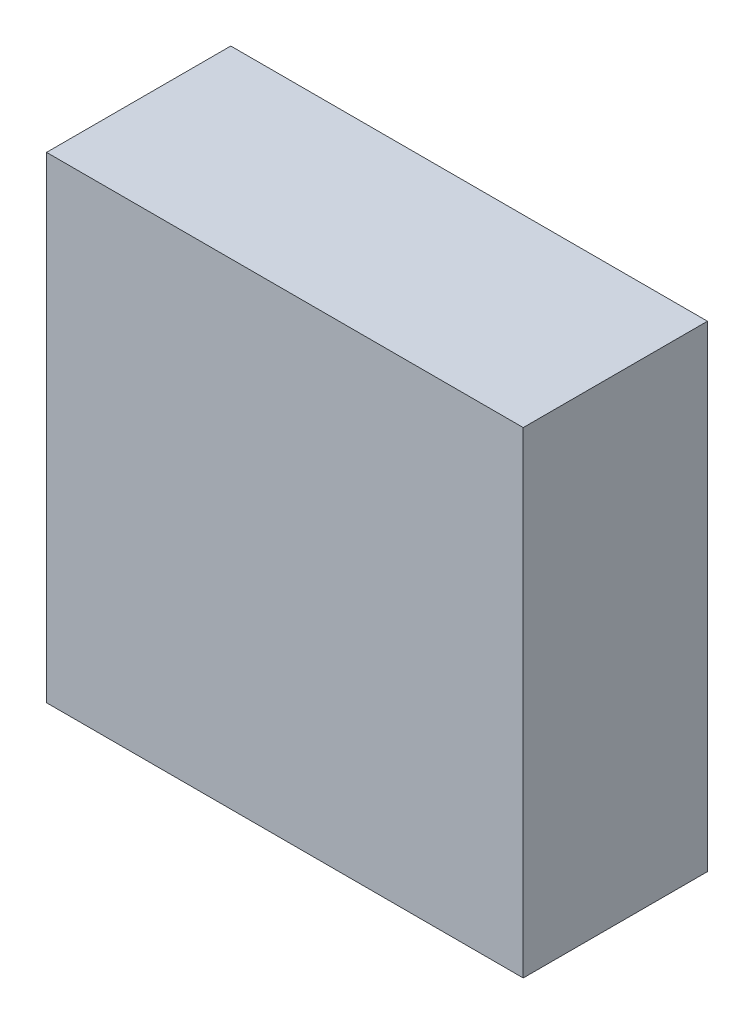
ISO-10303-21;
HEADER;
FILE_DESCRIPTION(('STEP AP214'),'2;1');
FILE_NAME('part.step','',(''),(''),'','','');
FILE_SCHEMA(('AUTOMOTIVE_DESIGN { 1 0 10303 214 1 1 1 1 }'));
ENDSEC;
DATA;
#1=APPLICATION_CONTEXT('core data for automotive mechanical design processes');
#2=APPLICATION_PROTOCOL_DEFINITION('international standard','automotive_design',2000,#1);
#3=PRODUCT_CONTEXT('',#1,'mechanical');
#4=PRODUCT('Part','Part','',(#3));
#5=PRODUCT_RELATED_PRODUCT_CATEGORY('part','',(#4));
#6=PRODUCT_DEFINITION_FORMATION('','',#4);
#7=PRODUCT_DEFINITION_CONTEXT('part definition',#1,'design');
#8=PRODUCT_DEFINITION('design','',#6,#7);
#9=PRODUCT_DEFINITION_SHAPE('','',#8);
#10=(LENGTH_UNIT() NAMED_UNIT(*) SI_UNIT(.MILLI.,.METRE.));
#11=(NAMED_UNIT(*) PLANE_ANGLE_UNIT() SI_UNIT($,.RADIAN.));
#12=(NAMED_UNIT(*) SI_UNIT($,.STERADIAN.) SOLID_ANGLE_UNIT());
#13=UNCERTAINTY_MEASURE_WITH_UNIT(LENGTH_MEASURE(1.E-05),#10,'distance_accuracy_value','');
#14=(GEOMETRIC_REPRESENTATION_CONTEXT(3) GLOBAL_UNCERTAINTY_ASSIGNED_CONTEXT((#13)) GLOBAL_UNIT_ASSIGNED_CONTEXT((#10,
#11,#12)) REPRESENTATION_CONTEXT('',''));
#15=CARTESIAN_POINT('',(0.,0.,0.));
#16=DIRECTION('',(0.,0.,1.));
#17=DIRECTION('',(1.,0.,0.));
#18=AXIS2_PLACEMENT_3D('',#15,#16,#17);
#19=CARTESIAN_POINT('',(0.,0.,22.8));
#20=DIRECTION('',(1.,0.,0.));
#21=DIRECTION('',(0.,0.,-1.));
#22=AXIS2_PLACEMENT_3D('',#19,#20,#21);
#23=PLANE('',#22);
#24=DIRECTION('',(0.,-1.,0.));
#25=VECTOR('',#24,1.);
#26=CARTESIAN_POINT('',(0.,0.,0.));
#27=LINE('',#26,#25);
#28=CARTESIAN_POINT('',(0.,59.,0.));
#29=VERTEX_POINT('',#28);
#30=CARTESIAN_POINT('',(0.,0.,0.));
#31=VERTEX_POINT('',#30);
#32=EDGE_CURVE('E96',#29,#31,#27,.T.);
#33=ORIENTED_EDGE('',*,*,#32,.T.);
#34=DIRECTION('',(0.,0.,-1.));
#35=VECTOR('',#34,1.);
#36=CARTESIAN_POINT('',(0.,0.,22.8));
#37=LINE('',#36,#35);
#38=CARTESIAN_POINT('',(0.,0.,22.8));
#39=VERTEX_POINT('',#38);
#40=EDGE_CURVE('E11',#39,#31,#37,.T.);
#41=ORIENTED_EDGE('',*,*,#40,.F.);
#42=DIRECTION('',(0.,-1.,0.));
#43=VECTOR('',#42,1.);
#44=CARTESIAN_POINT('',(0.,0.,22.8));
#45=LINE('',#44,#43);
#46=CARTESIAN_POINT('',(0.,59.,22.8));
#47=VERTEX_POINT('',#46);
#48=EDGE_CURVE('E84',#47,#39,#45,.T.);
#49=ORIENTED_EDGE('',*,*,#48,.F.);
#50=DIRECTION('',(0.,0.,-1.));
#51=VECTOR('',#50,1.);
#52=CARTESIAN_POINT('',(0.,59.,22.8));
#53=LINE('',#52,#51);
#54=EDGE_CURVE('E92',#47,#29,#53,.T.);
#55=ORIENTED_EDGE('',*,*,#54,.T.);
#56=EDGE_LOOP('',(#33,#41,#49,#55));
#57=FACE_BOUND('',#56,.T.);
#58=ADVANCED_FACE('F33',(#57),#23,.F.);
#59=CARTESIAN_POINT('',(0.,0.,22.8));
#60=DIRECTION('',(0.,1.,0.));
#61=DIRECTION('',(0.,0.,1.));
#62=AXIS2_PLACEMENT_3D('',#59,#60,#61);
#63=PLANE('',#62);
#64=DIRECTION('',(1.,0.,0.));
#65=VECTOR('',#64,1.);
#66=CARTESIAN_POINT('',(0.,0.,0.));
#67=LINE('',#66,#65);
#68=CARTESIAN_POINT('',(59.,0.,0.));
#69=VERTEX_POINT('',#68);
#70=EDGE_CURVE('E88',#31,#69,#67,.T.);
#71=ORIENTED_EDGE('',*,*,#70,.T.);
#72=DIRECTION('',(0.,0.,-1.));
#73=VECTOR('',#72,1.);
#74=CARTESIAN_POINT('',(59.,0.,22.8));
#75=LINE('',#74,#73);
#76=CARTESIAN_POINT('',(59.,0.,22.8));
#77=VERTEX_POINT('',#76);
#78=EDGE_CURVE('E41',#77,#69,#75,.T.);
#79=ORIENTED_EDGE('',*,*,#78,.F.);
#80=DIRECTION('',(1.,0.,0.));
#81=VECTOR('',#80,1.);
#82=CARTESIAN_POINT('',(0.,0.,22.8));
#83=LINE('',#82,#81);
#84=EDGE_CURVE('E79',#39,#77,#83,.T.);
#85=ORIENTED_EDGE('',*,*,#84,.F.);
#86=ORIENTED_EDGE('',*,*,#40,.T.);
#87=EDGE_LOOP('',(#71,#79,#85,#86));
#88=FACE_BOUND('',#87,.T.);
#89=ADVANCED_FACE('F87',(#88),#63,.F.);
#90=CARTESIAN_POINT('',(59.,0.,22.8));
#91=DIRECTION('',(-1.,0.,0.));
#92=DIRECTION('',(0.,0.,1.));
#93=AXIS2_PLACEMENT_3D('',#90,#91,#92);
#94=PLANE('',#93);
#95=DIRECTION('',(0.,1.,0.));
#96=VECTOR('',#95,1.);
#97=CARTESIAN_POINT('',(59.,0.,0.));
#98=LINE('',#97,#96);
#99=CARTESIAN_POINT('',(59.,59.,0.));
#100=VERTEX_POINT('',#99);
#101=EDGE_CURVE('E66',#69,#100,#98,.T.);
#102=ORIENTED_EDGE('',*,*,#101,.T.);
#103=DIRECTION('',(0.,0.,-1.));
#104=VECTOR('',#103,1.);
#105=CARTESIAN_POINT('',(59.,59.,22.8));
#106=LINE('',#105,#104);
#107=CARTESIAN_POINT('',(59.,59.,22.8));
#108=VERTEX_POINT('',#107);
#109=EDGE_CURVE('E89',#108,#100,#106,.T.);
#110=ORIENTED_EDGE('',*,*,#109,.F.);
#111=DIRECTION('',(0.,1.,0.));
#112=VECTOR('',#111,1.);
#113=CARTESIAN_POINT('',(59.,0.,22.8));
#114=LINE('',#113,#112);
#115=EDGE_CURVE('E82',#77,#108,#114,.T.);
#116=ORIENTED_EDGE('',*,*,#115,.F.);
#117=ORIENTED_EDGE('',*,*,#78,.T.);
#118=EDGE_LOOP('',(#102,#110,#116,#117));
#119=FACE_BOUND('',#118,.T.);
#120=ADVANCED_FACE('F90',(#119),#94,.F.);
#121=CARTESIAN_POINT('',(0.,59.,22.8));
#122=DIRECTION('',(0.,-1.,0.));
#123=DIRECTION('',(0.,0.,-1.));
#124=AXIS2_PLACEMENT_3D('',#121,#122,#123);
#125=PLANE('',#124);
#126=DIRECTION('',(-1.,0.,0.));
#127=VECTOR('',#126,1.);
#128=CARTESIAN_POINT('',(0.,59.,0.));
#129=LINE('',#128,#127);
#130=EDGE_CURVE('E72',#100,#29,#129,.T.);
#131=ORIENTED_EDGE('',*,*,#130,.T.);
#132=ORIENTED_EDGE('',*,*,#54,.F.);
#133=DIRECTION('',(-1.,0.,0.));
#134=VECTOR('',#133,1.);
#135=CARTESIAN_POINT('',(0.,59.,22.8));
#136=LINE('',#135,#134);
#137=EDGE_CURVE('E49',#108,#47,#136,.T.);
#138=ORIENTED_EDGE('',*,*,#137,.F.);
#139=ORIENTED_EDGE('',*,*,#109,.T.);
#140=EDGE_LOOP('',(#131,#132,#138,#139));
#141=FACE_BOUND('',#140,.T.);
#142=ADVANCED_FACE('F103',(#141),#125,.F.);
#143=CARTESIAN_POINT('',(0.,0.,22.8));
#144=DIRECTION('',(0.,0.,-1.));
#145=DIRECTION('',(-1.,0.,0.));
#146=AXIS2_PLACEMENT_3D('',#143,#144,#145);
#147=PLANE('',#146);
#148=ORIENTED_EDGE('',*,*,#48,.T.);
#149=ORIENTED_EDGE('',*,*,#84,.T.);
#150=ORIENTED_EDGE('',*,*,#115,.T.);
#151=ORIENTED_EDGE('',*,*,#137,.T.);
#152=EDGE_LOOP('',(#148,#149,#150,#151));
#153=FACE_BOUND('',#152,.T.);
#154=ADVANCED_FACE('F80',(#153),#147,.F.);
#155=CARTESIAN_POINT('',(0.,0.,0.));
#156=DIRECTION('',(0.,0.,-1.));
#157=DIRECTION('',(-1.,0.,0.));
#158=AXIS2_PLACEMENT_3D('',#155,#156,#157);
#159=PLANE('',#158);
#160=ORIENTED_EDGE('',*,*,#32,.F.);
#161=ORIENTED_EDGE('',*,*,#130,.F.);
#162=ORIENTED_EDGE('',*,*,#101,.F.);
#163=ORIENTED_EDGE('',*,*,#70,.F.);
#164=EDGE_LOOP('',(#160,#161,#162,#163));
#165=FACE_BOUND('',#164,.T.);
#166=ADVANCED_FACE('F106',(#165),#159,.T.);
#167=CLOSED_SHELL('',(#58,#89,#120,#142,#154,#166));
#168=MANIFOLD_SOLID_BREP('B2',#167);
#169=ADVANCED_BREP_SHAPE_REPRESENTATION('',(#18,#168),#14);
#170=SHAPE_DEFINITION_REPRESENTATION(#9,#169);
ENDSEC;
END-ISO-10303-21;
